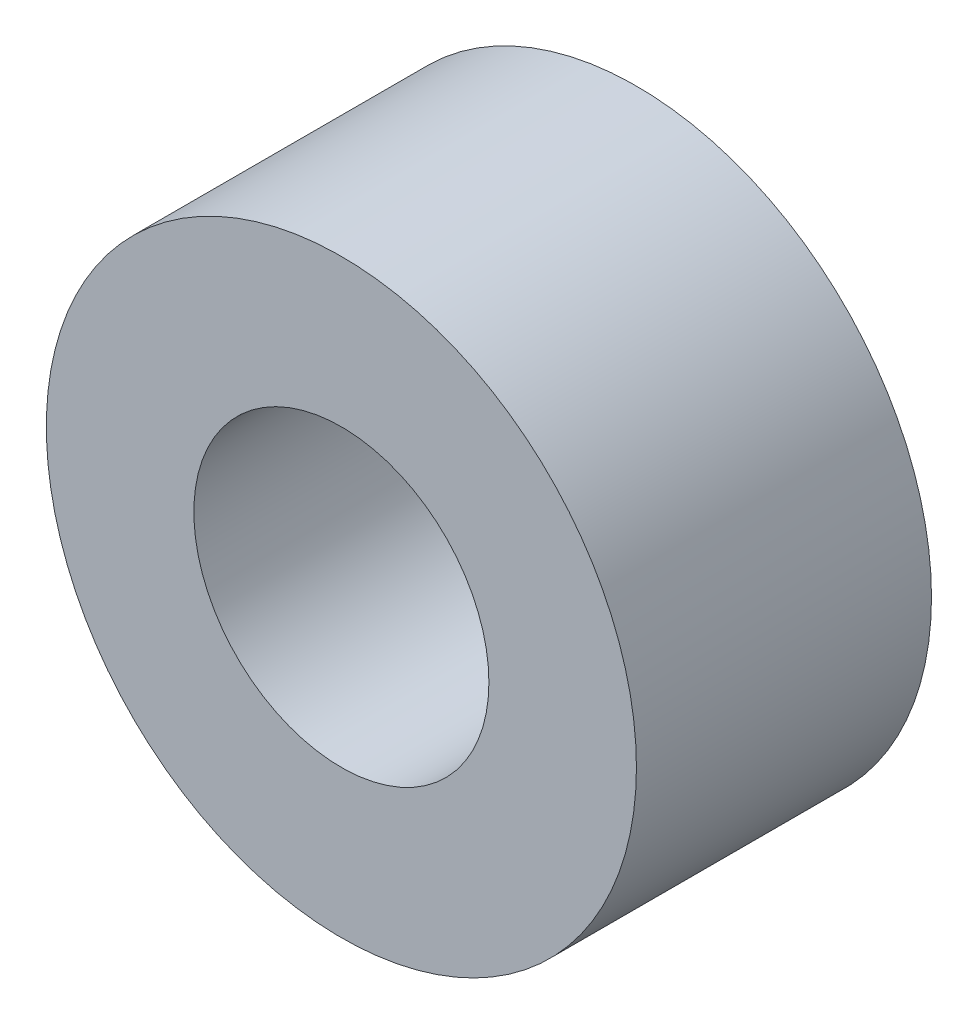
ISO-10303-21;
HEADER;
FILE_DESCRIPTION(('STEP AP214'),'2;1');
FILE_NAME('part.step','',(''),(''),'','','');
FILE_SCHEMA(('AUTOMOTIVE_DESIGN { 1 0 10303 214 1 1 1 1 }'));
ENDSEC;
DATA;
#1=APPLICATION_CONTEXT('core data for automotive mechanical design processes');
#2=APPLICATION_PROTOCOL_DEFINITION('international standard','automotive_design',2000,#1);
#3=PRODUCT_CONTEXT('',#1,'mechanical');
#4=PRODUCT('Part','Part','',(#3));
#5=PRODUCT_RELATED_PRODUCT_CATEGORY('part','',(#4));
#6=PRODUCT_DEFINITION_FORMATION('','',#4);
#7=PRODUCT_DEFINITION_CONTEXT('part definition',#1,'design');
#8=PRODUCT_DEFINITION('design','',#6,#7);
#9=PRODUCT_DEFINITION_SHAPE('','',#8);
#10=(LENGTH_UNIT() NAMED_UNIT(*) SI_UNIT(.MILLI.,.METRE.));
#11=(NAMED_UNIT(*) PLANE_ANGLE_UNIT() SI_UNIT($,.RADIAN.));
#12=(NAMED_UNIT(*) SI_UNIT($,.STERADIAN.) SOLID_ANGLE_UNIT());
#13=UNCERTAINTY_MEASURE_WITH_UNIT(LENGTH_MEASURE(1.E-05),#10,'distance_accuracy_value','');
#14=(GEOMETRIC_REPRESENTATION_CONTEXT(3) GLOBAL_UNCERTAINTY_ASSIGNED_CONTEXT((#13)) GLOBAL_UNIT_ASSIGNED_CONTEXT((#10,
#11,#12)) REPRESENTATION_CONTEXT('',''));
#15=CARTESIAN_POINT('',(0.,0.,0.));
#16=DIRECTION('',(0.,0.,1.));
#17=DIRECTION('',(1.,0.,0.));
#18=AXIS2_PLACEMENT_3D('',#15,#16,#17);
#19=CARTESIAN_POINT('',(0.,0.,2.));
#20=DIRECTION('',(0.,0.,1.));
#21=DIRECTION('',(1.,0.,0.));
#22=AXIS2_PLACEMENT_3D('',#19,#20,#21);
#23=PLANE('',#22);
#24=CARTESIAN_POINT('',(0.,0.,2.));
#25=DIRECTION('',(0.,0.,1.));
#26=DIRECTION('',(1.,0.,0.));
#27=AXIS2_PLACEMENT_3D('',#24,#25,#26);
#28=CIRCLE('',#27,2.);
#29=CARTESIAN_POINT('',(2.,0.,2.));
#30=VERTEX_POINT('',#29);
#31=EDGE_CURVE('E10',#30,#30,#28,.T.);
#32=ORIENTED_EDGE('',*,*,#31,.T.);
#33=EDGE_LOOP('',(#32));
#34=FACE_BOUND('',#33,.T.);
#35=CARTESIAN_POINT('',(0.,0.,2.));
#36=DIRECTION('',(0.,0.,1.));
#37=DIRECTION('',(1.,0.,0.));
#38=AXIS2_PLACEMENT_3D('',#35,#36,#37);
#39=CIRCLE('',#38,1.);
#40=CARTESIAN_POINT('',(1.,0.,2.));
#41=VERTEX_POINT('',#40);
#42=EDGE_CURVE('E42',#41,#41,#39,.T.);
#43=ORIENTED_EDGE('',*,*,#42,.F.);
#44=EDGE_LOOP('',(#43));
#45=FACE_BOUND('',#44,.T.);
#46=ADVANCED_FACE('F31',(#34,#45),#23,.T.);
#47=CARTESIAN_POINT('',(0.,0.,0.));
#48=DIRECTION('',(0.,0.,1.));
#49=DIRECTION('',(1.,0.,0.));
#50=AXIS2_PLACEMENT_3D('',#47,#48,#49);
#51=PLANE('',#50);
#52=CARTESIAN_POINT('',(0.,0.,0.));
#53=DIRECTION('',(0.,0.,1.));
#54=DIRECTION('',(1.,0.,0.));
#55=AXIS2_PLACEMENT_3D('',#52,#53,#54);
#56=CIRCLE('',#55,2.);
#57=CARTESIAN_POINT('',(2.,0.,0.));
#58=VERTEX_POINT('',#57);
#59=EDGE_CURVE('E35',#58,#58,#56,.T.);
#60=ORIENTED_EDGE('',*,*,#59,.F.);
#61=EDGE_LOOP('',(#60));
#62=FACE_BOUND('',#61,.T.);
#63=CARTESIAN_POINT('',(0.,0.,0.));
#64=DIRECTION('',(0.,0.,1.));
#65=DIRECTION('',(1.,0.,0.));
#66=AXIS2_PLACEMENT_3D('',#63,#64,#65);
#67=CIRCLE('',#66,1.);
#68=CARTESIAN_POINT('',(1.,0.,0.));
#69=VERTEX_POINT('',#68);
#70=EDGE_CURVE('E44',#69,#69,#67,.T.);
#71=ORIENTED_EDGE('',*,*,#70,.T.);
#72=EDGE_LOOP('',(#71));
#73=FACE_BOUND('',#72,.T.);
#74=ADVANCED_FACE('F54',(#62,#73),#51,.F.);
#75=CARTESIAN_POINT('',(0.,0.,2.));
#76=DIRECTION('',(0.,0.,-1.));
#77=DIRECTION('',(-1.,0.,0.));
#78=AXIS2_PLACEMENT_3D('',#75,#76,#77);
#79=CYLINDRICAL_SURFACE('',#78,2.);
#80=ORIENTED_EDGE('',*,*,#31,.F.);
#81=EDGE_LOOP('',(#80));
#82=FACE_BOUND('',#81,.T.);
#83=ORIENTED_EDGE('',*,*,#59,.T.);
#84=EDGE_LOOP('',(#83));
#85=FACE_BOUND('',#84,.T.);
#86=ADVANCED_FACE('F33',(#82,#85),#79,.T.);
#87=CARTESIAN_POINT('',(0.,0.,2.));
#88=DIRECTION('',(0.,0.,-1.));
#89=DIRECTION('',(-1.,0.,0.));
#90=AXIS2_PLACEMENT_3D('',#87,#88,#89);
#91=CYLINDRICAL_SURFACE('',#90,1.);
#92=ORIENTED_EDGE('',*,*,#42,.T.);
#93=EDGE_LOOP('',(#92));
#94=FACE_BOUND('',#93,.T.);
#95=ORIENTED_EDGE('',*,*,#70,.F.);
#96=EDGE_LOOP('',(#95));
#97=FACE_BOUND('',#96,.T.);
#98=ADVANCED_FACE('F50',(#94,#97),#91,.F.);
#99=CLOSED_SHELL('',(#46,#74,#86,#98));
#100=MANIFOLD_SOLID_BREP('B2',#99);
#101=ADVANCED_BREP_SHAPE_REPRESENTATION('',(#18,#100),#14);
#102=SHAPE_DEFINITION_REPRESENTATION(#9,#101);
ENDSEC;
END-ISO-10303-21;
